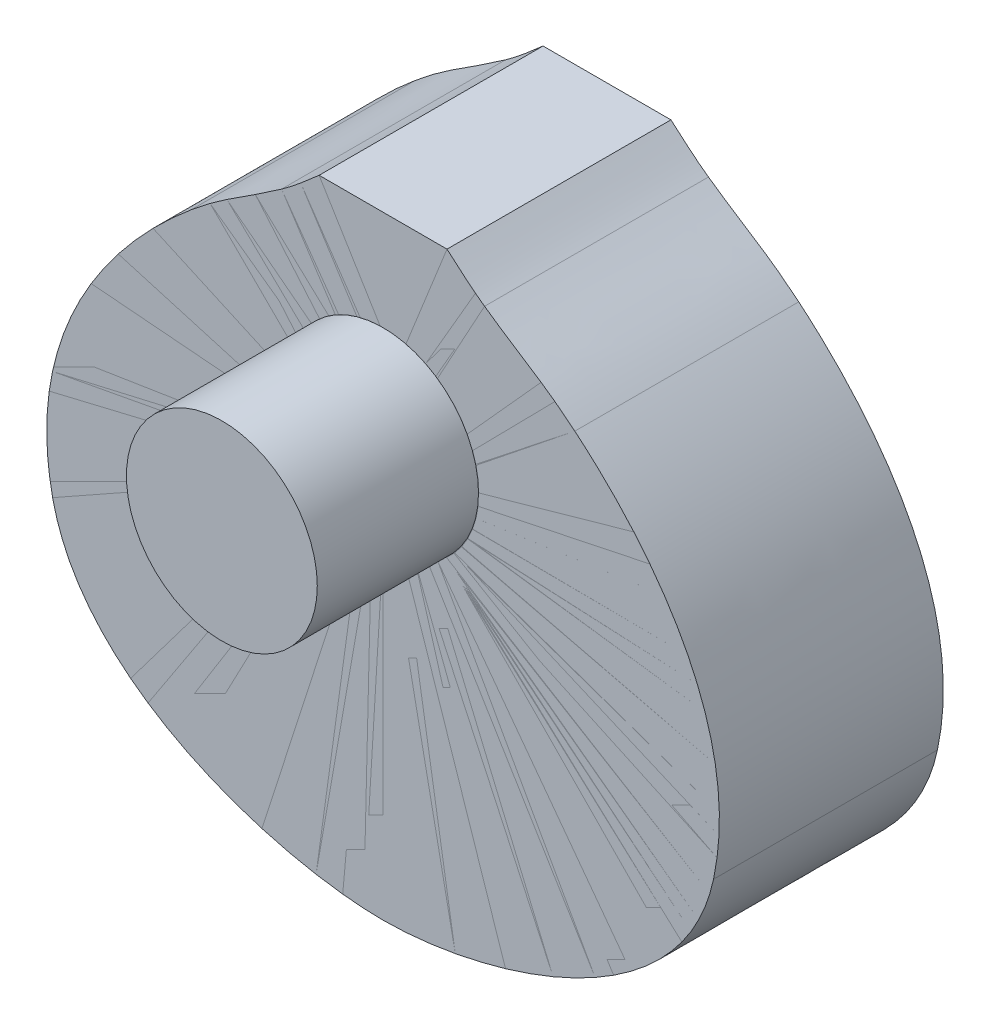
ISO-10303-21;
HEADER;
FILE_DESCRIPTION(('STEP AP214'),'2;1');
FILE_NAME('part.step','',(''),(''),'','','');
FILE_SCHEMA(('AUTOMOTIVE_DESIGN { 1 0 10303 214 1 1 1 1 }'));
ENDSEC;
DATA;
#1=APPLICATION_CONTEXT('core data for automotive mechanical design processes');
#2=APPLICATION_PROTOCOL_DEFINITION('international standard','automotive_design',2000,#1);
#3=PRODUCT_CONTEXT('',#1,'mechanical');
#4=PRODUCT('Part','Part','',(#3));
#5=PRODUCT_RELATED_PRODUCT_CATEGORY('part','',(#4));
#6=PRODUCT_DEFINITION_FORMATION('','',#4);
#7=PRODUCT_DEFINITION_CONTEXT('part definition',#1,'design');
#8=PRODUCT_DEFINITION('design','',#6,#7);
#9=PRODUCT_DEFINITION_SHAPE('','',#8);
#10=(LENGTH_UNIT() NAMED_UNIT(*) SI_UNIT(.MILLI.,.METRE.));
#11=(NAMED_UNIT(*) PLANE_ANGLE_UNIT() SI_UNIT($,.RADIAN.));
#12=(NAMED_UNIT(*) SI_UNIT($,.STERADIAN.) SOLID_ANGLE_UNIT());
#13=UNCERTAINTY_MEASURE_WITH_UNIT(LENGTH_MEASURE(1.E-05),#10,'distance_accuracy_value','');
#14=(GEOMETRIC_REPRESENTATION_CONTEXT(3) GLOBAL_UNCERTAINTY_ASSIGNED_CONTEXT((#13)) GLOBAL_UNIT_ASSIGNED_CONTEXT((#10,
#11,#12)) REPRESENTATION_CONTEXT('',''));
#15=CARTESIAN_POINT('',(0.,0.,0.));
#16=DIRECTION('',(0.,0.,1.));
#17=DIRECTION('',(1.,0.,0.));
#18=AXIS2_PLACEMENT_3D('',#15,#16,#17);
#19=CARTESIAN_POINT('',(-86.0503422010161,-116.244162405099,100.));
#20=DIRECTION('',(0.,0.,1.));
#21=DIRECTION('',(1.,0.,0.));
#22=AXIS2_PLACEMENT_3D('',#19,#20,#21);
#23=PLANE('',#22);
#24=CARTESIAN_POINT('',(-147.578497365594,-47.2764964103053,100.));
#25=CARTESIAN_POINT('',(-133.833406390178,-111.670406770875,100.));
#26=CARTESIAN_POINT('',(-46.441340442,-136.916395601955,100.));
#27=CARTESIAN_POINT('',(2.54000098731666E-07,-136.916395712,100.));
#28=B_SPLINE_CURVE_WITH_KNOTS('',3,(#24,#25,#26,#27),.UNSPECIFIED.,.F.,.F.,(4,4),(0.,1.),.UNSPECIFIED.);
#29=CARTESIAN_POINT('',(-147.578497365594,-47.2764964103053,100.));
#30=VERTEX_POINT('',#29);
#31=CARTESIAN_POINT('',(2.53999987709363E-07,-136.916395712,100.));
#32=VERTEX_POINT('',#31);
#33=EDGE_CURVE('E55',#30,#32,#28,.T.);
#34=ORIENTED_EDGE('',*,*,#33,.T.);
#35=DIRECTION('',(0.,1.,0.));
#36=VECTOR('',#35,1.);
#37=CARTESIAN_POINT('',(2.54000043220515E-07,6.76991712428551,100.));
#38=LINE('',#37,#36);
#39=CARTESIAN_POINT('',(2.54000035364103E-07,6.76991712428551,100.));
#40=VERTEX_POINT('',#39);
#41=EDGE_CURVE('E78',#32,#40,#38,.T.);
#42=ORIENTED_EDGE('',*,*,#41,.T.);
#43=CARTESIAN_POINT('',(2.54000043220515E-07,49.5382312132487,100.));
#44=DIRECTION('',(0.,0.,-1.));
#45=DIRECTION('',(1.,0.,0.));
#46=AXIS2_PLACEMENT_3D('',#43,#44,#45);
#47=CIRCLE('',#46,42.7683140889631);
#48=CARTESIAN_POINT('',(2.5400007097609E-07,92.3065453022118,100.));
#49=VERTEX_POINT('',#48);
#50=EDGE_CURVE('E83',#40,#49,#47,.T.);
#51=ORIENTED_EDGE('',*,*,#50,.T.);
#52=DIRECTION('',(0.,1.,0.));
#53=VECTOR('',#52,1.);
#54=CARTESIAN_POINT('',(2.54000043220515E-07,136.916395712,100.));
#55=LINE('',#54,#53);
#56=CARTESIAN_POINT('',(2.54000043220515E-07,136.916395712,100.));
#57=VERTEX_POINT('',#56);
#58=EDGE_CURVE('E88',#49,#57,#55,.T.);
#59=ORIENTED_EDGE('',*,*,#58,.T.);
#60=DIRECTION('',(-1.,0.,0.));
#61=VECTOR('',#60,1.);
#62=CARTESIAN_POINT('',(-28.5608021619999,136.916395712,100.));
#63=LINE('',#62,#61);
#64=CARTESIAN_POINT('',(-28.5608021619999,136.916395712,100.));
#65=VERTEX_POINT('',#64);
#66=EDGE_CURVE('E95',#57,#65,#63,.T.);
#67=ORIENTED_EDGE('',*,*,#66,.T.);
#68=CARTESIAN_POINT('',(-28.5608021619999,136.916395712,100.));
#69=CARTESIAN_POINT('',(-33.9335229379999,132.194713512,100.));
#70=CARTESIAN_POINT('',(-39.5023428899999,127.304974752,100.));
#71=CARTESIAN_POINT('',(-45.3232060259999,123.188624336,100.));
#72=B_SPLINE_CURVE_WITH_KNOTS('',3,(#68,#69,#70,#71),.UNSPECIFIED.,.F.,.F.,(4,4),(0.,1.),.UNSPECIFIED.);
#73=CARTESIAN_POINT('',(-45.3232060259999,123.188624336,100.));
#74=VERTEX_POINT('',#73);
#75=EDGE_CURVE('E98',#65,#74,#72,.T.);
#76=ORIENTED_EDGE('',*,*,#75,.T.);
#77=CARTESIAN_POINT('',(-45.3232060259999,123.188624336,100.));
#78=CARTESIAN_POINT('',(-62.7857659699999,110.83954464,100.));
#79=CARTESIAN_POINT('',(-70.7786958819999,107.475422336,100.));
#80=CARTESIAN_POINT('',(-85.6393976819999,95.0587593360001,100.));
#81=B_SPLINE_CURVE_WITH_KNOTS('',3,(#77,#78,#79,#80),.UNSPECIFIED.,.F.,.F.,(4,4),(0.,1.),.UNSPECIFIED.);
#82=CARTESIAN_POINT('',(-85.6393976819999,95.0587593360001,100.));
#83=VERTEX_POINT('',#82);
#84=EDGE_CURVE('E51',#74,#83,#81,.T.);
#85=ORIENTED_EDGE('',*,*,#84,.T.);
#86=CARTESIAN_POINT('',(-85.6393976819999,95.0587593360001,100.));
#87=CARTESIAN_POINT('',(-105.36071774303,78.5808853673423,100.));
#88=CARTESIAN_POINT('',(-163.110192586785,25.4872575653832,100.));
#89=CARTESIAN_POINT('',(-147.578497365594,-47.2764964103053,100.));
#90=B_SPLINE_CURVE_WITH_KNOTS('',3,(#86,#87,#88,#89),.UNSPECIFIED.,.F.,.F.,(4,4),(0.,1.),.UNSPECIFIED.);
#91=EDGE_CURVE('E12',#83,#30,#90,.T.);
#92=ORIENTED_EDGE('',*,*,#91,.T.);
#93=EDGE_LOOP('',(#34,#42,#51,#59,#67,#76,#85,#92));
#94=FACE_BOUND('',#93,.T.);
#95=ADVANCED_FACE('F44',(#94),#23,.T.);
#96=OPEN_SHELL('',(#95));
#97=SHELL_BASED_SURFACE_MODEL('B2',(#96));
#98=CARTESIAN_POINT('',(2.54000051894132E-07,49.5382312132486,100.));
#99=DIRECTION('',(0.,0.,-1.));
#100=DIRECTION('',(-1.,0.,0.));
#101=AXIS2_PLACEMENT_3D('',#98,#99,#100);
#102=PLANE('',#101);
#103=DIRECTION('',(-1.,0.,0.));
#104=VECTOR('',#103,1.);
#105=CARTESIAN_POINT('',(28.5608026699999,136.916395712,100.));
#106=LINE('',#105,#104);
#107=CARTESIAN_POINT('',(28.5608026699999,136.916395712,100.));
#108=VERTEX_POINT('',#107);
#109=CARTESIAN_POINT('',(2.54000051894132E-07,136.916395712,100.));
#110=VERTEX_POINT('',#109);
#111=EDGE_CURVE('E164',#108,#110,#106,.T.);
#112=ORIENTED_EDGE('',*,*,#111,.T.);
#113=DIRECTION('',(0.,-1.,0.));
#114=VECTOR('',#113,1.);
#115=CARTESIAN_POINT('',(2.54000051894132E-07,136.916395712,100.));
#116=LINE('',#115,#114);
#117=CARTESIAN_POINT('',(2.54000051894132E-07,92.3065453022117,100.));
#118=VERTEX_POINT('',#117);
#119=EDGE_CURVE('E187',#110,#118,#116,.T.);
#120=ORIENTED_EDGE('',*,*,#119,.T.);
#121=CARTESIAN_POINT('',(2.54000051894132E-07,49.5382312132486,100.));
#122=DIRECTION('',(0.,0.,-1.));
#123=DIRECTION('',(-1.,0.,0.));
#124=AXIS2_PLACEMENT_3D('',#121,#122,#123);
#125=CIRCLE('',#124,42.7683140889631);
#126=CARTESIAN_POINT('',(2.54000059750544E-07,6.76991712428546,100.));
#127=VERTEX_POINT('',#126);
#128=EDGE_CURVE('E192',#118,#127,#125,.T.);
#129=ORIENTED_EDGE('',*,*,#128,.T.);
#130=DIRECTION('',(0.,-1.,0.));
#131=VECTOR('',#130,1.);
#132=CARTESIAN_POINT('',(2.54000051894132E-07,6.76991712428546,100.));
#133=LINE('',#132,#131);
#134=CARTESIAN_POINT('',(2.5399994087183E-07,-136.916395712,100.));
#135=VERTEX_POINT('',#134);
#136=EDGE_CURVE('E197',#127,#135,#133,.T.);
#137=ORIENTED_EDGE('',*,*,#136,.T.);
#138=CARTESIAN_POINT('',(2.54000051894132E-07,-136.916395712,100.));
#139=CARTESIAN_POINT('',(46.4413409500002,-136.916395601955,100.));
#140=CARTESIAN_POINT('',(133.833406898179,-111.670406770875,100.));
#141=CARTESIAN_POINT('',(147.578497873594,-47.2764964103053,100.));
#142=B_SPLINE_CURVE_WITH_KNOTS('',3,(#138,#139,#140,#141),.UNSPECIFIED.,.F.,.F.,(4,4),(0.,1.),.UNSPECIFIED.);
#143=CARTESIAN_POINT('',(147.578497873594,-47.2764964103053,100.));
#144=VERTEX_POINT('',#143);
#145=EDGE_CURVE('E202',#135,#144,#142,.T.);
#146=ORIENTED_EDGE('',*,*,#145,.T.);
#147=CARTESIAN_POINT('',(147.578497873594,-47.2764964103053,100.));
#148=CARTESIAN_POINT('',(163.110193094786,25.4872575653832,100.));
#149=CARTESIAN_POINT('',(105.36071825103,78.5808853673423,100.));
#150=CARTESIAN_POINT('',(85.63939819,95.058759336,100.));
#151=B_SPLINE_CURVE_WITH_KNOTS('',3,(#147,#148,#149,#150),.UNSPECIFIED.,.F.,.F.,(4,4),(0.,1.),.UNSPECIFIED.);
#152=CARTESIAN_POINT('',(85.63939819,95.058759336,100.));
#153=VERTEX_POINT('',#152);
#154=EDGE_CURVE('E207',#144,#153,#151,.T.);
#155=ORIENTED_EDGE('',*,*,#154,.T.);
#156=CARTESIAN_POINT('',(85.63939819,95.058759336,100.));
#157=CARTESIAN_POINT('',(70.77869639,107.475422336,100.));
#158=CARTESIAN_POINT('',(62.7857664779999,110.83954464,100.));
#159=CARTESIAN_POINT('',(45.323206534,123.188624336,100.));
#160=B_SPLINE_CURVE_WITH_KNOTS('',3,(#156,#157,#158,#159),.UNSPECIFIED.,.F.,.F.,(4,4),(0.,1.),.UNSPECIFIED.);
#161=CARTESIAN_POINT('',(45.323206534,123.188624336,100.));
#162=VERTEX_POINT('',#161);
#163=EDGE_CURVE('E160',#153,#162,#160,.T.);
#164=ORIENTED_EDGE('',*,*,#163,.T.);
#165=CARTESIAN_POINT('',(45.323206534,123.188624336,100.));
#166=CARTESIAN_POINT('',(39.502343398,127.304974752,100.));
#167=CARTESIAN_POINT('',(33.933523446,132.194713512,100.));
#168=CARTESIAN_POINT('',(28.5608026699999,136.916395712,100.));
#169=B_SPLINE_CURVE_WITH_KNOTS('',3,(#165,#166,#167,#168),.UNSPECIFIED.,.F.,.F.,(4,4),(0.,1.),.UNSPECIFIED.);
#170=EDGE_CURVE('E42',#162,#108,#169,.T.);
#171=ORIENTED_EDGE('',*,*,#170,.T.);
#172=EDGE_LOOP('',(#112,#120,#129,#137,#146,#155,#164,#171));
#173=FACE_BOUND('',#172,.T.);
#174=ADVANCED_FACE('F153',(#173),#102,.F.);
#175=OPEN_SHELL('',(#174));
#176=SHELL_BASED_SURFACE_MODEL('B6',(#175));
#177=CARTESIAN_POINT('',(-86.0503422010161,-116.244162405099,100.));
#178=DIRECTION('',(0.,0.,1.));
#179=DIRECTION('',(1.,0.,0.));
#180=AXIS2_PLACEMENT_3D('',#177,#178,#179);
#181=PLANE('',#180);
#182=CARTESIAN_POINT('',(-147.578497365594,-47.2764964103054,100.));
#183=CARTESIAN_POINT('',(-133.833406390178,-111.670406770875,100.));
#184=CARTESIAN_POINT('',(-46.441340442,-136.916395601955,100.));
#185=CARTESIAN_POINT('',(2.54000087163701E-07,-136.916395712,100.));
#186=B_SPLINE_CURVE_WITH_KNOTS('',3,(#182,#183,#184,#185),.UNSPECIFIED.,.F.,.F.,(4,4),(0.,1.),.UNSPECIFIED.);
#187=CARTESIAN_POINT('',(-147.578497365594,-47.2764964103054,100.));
#188=VERTEX_POINT('',#187);
#189=CARTESIAN_POINT('',(2.53999985488917E-07,-136.916395712,100.));
#190=VERTEX_POINT('',#189);
#191=EDGE_CURVE('E304',#188,#190,#186,.T.);
#192=ORIENTED_EDGE('',*,*,#191,.T.);
#193=CARTESIAN_POINT('',(0.,-136.916395712,100.));
#194=CARTESIAN_POINT('',(46.4413406959999,-136.916395629466,100.));
#195=CARTESIAN_POINT('',(133.833406659134,-111.670406850156,100.));
#196=CARTESIAN_POINT('',(147.578497672695,-47.2764964977289,100.));
#197=B_SPLINE_CURVE_WITH_KNOTS('',3,(#193,#194,#195,#196),.UNSPECIFIED.,.F.,.F.,(4,4),(0.,1.),.UNSPECIFIED.);
#198=CARTESIAN_POINT('',(147.578497672695,-47.2764964977289,100.));
#199=VERTEX_POINT('',#198);
#200=EDGE_CURVE('E439',#190,#199,#197,.T.);
#201=ORIENTED_EDGE('',*,*,#200,.T.);
#202=CARTESIAN_POINT('',(147.578497672695,-47.2764964977289,100.));
#203=CARTESIAN_POINT('',(163.110192996589,25.4872574560373,100.));
#204=CARTESIAN_POINT('',(105.360718227773,78.5808853395067,100.));
#205=CARTESIAN_POINT('',(85.63939819,95.058759336,100.));
#206=B_SPLINE_CURVE_WITH_KNOTS('',3,(#202,#203,#204,#205),.UNSPECIFIED.,.F.,.F.,(4,4),(0.,1.),.UNSPECIFIED.);
#207=CARTESIAN_POINT('',(85.63939819,95.058759336,100.));
#208=VERTEX_POINT('',#207);
#209=EDGE_CURVE('E450',#199,#208,#206,.T.);
#210=ORIENTED_EDGE('',*,*,#209,.T.);
#211=CARTESIAN_POINT('',(85.63939819,95.058759336,100.));
#212=CARTESIAN_POINT('',(70.77869639,107.475422336,100.));
#213=CARTESIAN_POINT('',(62.785766478,110.83954464,100.));
#214=CARTESIAN_POINT('',(45.323206534,123.188624336,100.));
#215=B_SPLINE_CURVE_WITH_KNOTS('',3,(#211,#212,#213,#214),.UNSPECIFIED.,.F.,.F.,(4,4),(0.,1.),.UNSPECIFIED.);
#216=CARTESIAN_POINT('',(45.323206534,123.188624336,100.));
#217=VERTEX_POINT('',#216);
#218=EDGE_CURVE('E499',#208,#217,#215,.T.);
#219=ORIENTED_EDGE('',*,*,#218,.T.);
#220=CARTESIAN_POINT('',(45.323206534,123.188624336,100.));
#221=CARTESIAN_POINT('',(39.502343398,127.304974752,100.));
#222=CARTESIAN_POINT('',(33.933523446,132.194713512,100.));
#223=CARTESIAN_POINT('',(28.56080267,136.916395712,100.));
#224=B_SPLINE_CURVE_WITH_KNOTS('',3,(#220,#221,#222,#223),.UNSPECIFIED.,.F.,.F.,(4,4),(0.,1.),.UNSPECIFIED.);
#225=CARTESIAN_POINT('',(28.56080267,136.916395712,100.));
#226=VERTEX_POINT('',#225);
#227=EDGE_CURVE('E480',#217,#226,#224,.T.);
#228=ORIENTED_EDGE('',*,*,#227,.T.);
#229=DIRECTION('',(-1.,0.,0.));
#230=VECTOR('',#229,1.);
#231=CARTESIAN_POINT('',(-28.5608021619999,136.916395712,100.));
#232=LINE('',#231,#230);
#233=CARTESIAN_POINT('',(-28.5608021619999,136.916395712,100.));
#234=VERTEX_POINT('',#233);
#235=EDGE_CURVE('E320',#226,#234,#232,.T.);
#236=ORIENTED_EDGE('',*,*,#235,.T.);
#237=CARTESIAN_POINT('',(-28.5608021619999,136.916395712,100.));
#238=CARTESIAN_POINT('',(-33.9335229379999,132.194713512,100.));
#239=CARTESIAN_POINT('',(-39.5023428899999,127.304974752,100.));
#240=CARTESIAN_POINT('',(-45.3232060259999,123.188624336,100.));
#241=B_SPLINE_CURVE_WITH_KNOTS('',3,(#237,#238,#239,#240),.UNSPECIFIED.,.F.,.F.,(4,4),(0.,1.),.UNSPECIFIED.);
#242=CARTESIAN_POINT('',(-45.3232060259999,123.188624336,100.));
#243=VERTEX_POINT('',#242);
#244=EDGE_CURVE('E313',#234,#243,#241,.T.);
#245=ORIENTED_EDGE('',*,*,#244,.T.);
#246=CARTESIAN_POINT('',(-45.3232060259999,123.188624336,100.));
#247=CARTESIAN_POINT('',(-62.7857659699999,110.83954464,100.));
#248=CARTESIAN_POINT('',(-70.7786958819999,107.475422336,100.));
#249=CARTESIAN_POINT('',(-85.6393976819999,95.058759336,100.));
#250=B_SPLINE_CURVE_WITH_KNOTS('',3,(#246,#247,#248,#249),.UNSPECIFIED.,.F.,.F.,(4,4),(0.,1.),.UNSPECIFIED.);
#251=CARTESIAN_POINT('',(-85.6393976819999,95.058759336,100.));
#252=VERTEX_POINT('',#251);
#253=EDGE_CURVE('E317',#243,#252,#250,.T.);
#254=ORIENTED_EDGE('',*,*,#253,.T.);
#255=CARTESIAN_POINT('',(-85.6393976819999,95.058759336,100.));
#256=CARTESIAN_POINT('',(-105.36071774303,78.5808853673423,100.));
#257=CARTESIAN_POINT('',(-163.110192586785,25.4872575653832,100.));
#258=CARTESIAN_POINT('',(-147.578497365594,-47.2764964103054,100.));
#259=B_SPLINE_CURVE_WITH_KNOTS('',3,(#255,#256,#257,#258),.UNSPECIFIED.,.F.,.F.,(4,4),(0.,1.),.UNSPECIFIED.);
#260=EDGE_CURVE('E271',#252,#188,#259,.T.);
#261=ORIENTED_EDGE('',*,*,#260,.T.);
#262=EDGE_LOOP('',(#192,#201,#210,#219,#228,#236,#245,#254,#261));
#263=FACE_BOUND('',#262,.T.);
#264=CARTESIAN_POINT('',(2.54000031916041E-07,49.6594816289135,100.));
#265=DIRECTION('',(0.,0.,1.));
#266=DIRECTION('',(1.,0.,0.));
#267=AXIS2_PLACEMENT_3D('',#264,#265,#266);
#268=CIRCLE('',#267,42.6235073127831);
#269=CARTESIAN_POINT('',(42.6235075667832,49.6594816289135,100.));
#270=VERTEX_POINT('',#269);
#271=EDGE_CURVE('E512',#270,#270,#268,.T.);
#272=ORIENTED_EDGE('',*,*,#271,.F.);
#273=EDGE_LOOP('',(#272));
#274=FACE_BOUND('',#273,.T.);
#275=ADVANCED_FACE('F253',(#263,#274),#181,.T.);
#276=DIRECTION('',(0.,0.,-1.));
#277=VECTOR('',#276,1.);
#278=SURFACE_OF_LINEAR_EXTRUSION('',#186,#277);
#279=CARTESIAN_POINT('',(-147.578497365594,-47.2764964103054,0.));
#280=CARTESIAN_POINT('',(-133.833406390178,-111.670406770875,0.));
#281=CARTESIAN_POINT('',(-46.441340442,-136.916395601955,0.));
#282=CARTESIAN_POINT('',(2.54000087163701E-07,-136.916395712,0.));
#283=B_SPLINE_CURVE_WITH_KNOTS('',3,(#279,#280,#281,#282),.UNSPECIFIED.,.F.,.F.,(4,4),(0.,1.),.UNSPECIFIED.);
#284=CARTESIAN_POINT('',(-147.578497365594,-47.2764964103054,0.));
#285=VERTEX_POINT('',#284);
#286=CARTESIAN_POINT('',(2.53999985488917E-07,-136.916395712,0.));
#287=VERTEX_POINT('',#286);
#288=EDGE_CURVE('E382',#285,#287,#283,.T.);
#289=ORIENTED_EDGE('',*,*,#288,.T.);
#290=DIRECTION('',(0.,0.,-1.));
#291=VECTOR('',#290,1.);
#292=CARTESIAN_POINT('',(2.53999985488917E-07,-136.916395712,100.));
#293=LINE('',#292,#291);
#294=EDGE_CURVE('E151',#190,#287,#293,.T.);
#295=ORIENTED_EDGE('',*,*,#294,.F.);
#296=ORIENTED_EDGE('',*,*,#191,.F.);
#297=DIRECTION('',(0.,0.,-1.));
#298=VECTOR('',#297,1.);
#299=CARTESIAN_POINT('',(-147.578497365594,-47.2764964103054,100.));
#300=LINE('',#299,#298);
#301=EDGE_CURVE('E333',#188,#285,#300,.T.);
#302=ORIENTED_EDGE('',*,*,#301,.T.);
#303=EDGE_LOOP('',(#289,#295,#296,#302));
#304=FACE_BOUND('',#303,.T.);
#305=ADVANCED_FACE('F255',(#304),#278,.F.);
#306=CARTESIAN_POINT('',(-28.5608021619999,136.916395712,100.));
#307=DIRECTION('',(0.,-1.,0.));
#308=DIRECTION('',(0.,0.,-1.));
#309=AXIS2_PLACEMENT_3D('',#306,#307,#308);
#310=PLANE('',#309);
#311=DIRECTION('',(-1.,0.,0.));
#312=VECTOR('',#311,1.);
#313=CARTESIAN_POINT('',(-28.5608021619999,136.916395712,0.));
#314=LINE('',#313,#312);
#315=CARTESIAN_POINT('',(28.56080267,136.916395712,0.));
#316=VERTEX_POINT('',#315);
#317=CARTESIAN_POINT('',(-28.5608021619999,136.916395712,0.));
#318=VERTEX_POINT('',#317);
#319=EDGE_CURVE('E386',#316,#318,#314,.T.);
#320=ORIENTED_EDGE('',*,*,#319,.T.);
#321=DIRECTION('',(0.,0.,-1.));
#322=VECTOR('',#321,1.);
#323=CARTESIAN_POINT('',(-28.5608021619999,136.916395712,100.));
#324=LINE('',#323,#322);
#325=EDGE_CURVE('E263',#234,#318,#324,.T.);
#326=ORIENTED_EDGE('',*,*,#325,.F.);
#327=ORIENTED_EDGE('',*,*,#235,.F.);
#328=DIRECTION('',(0.,0.,-1.));
#329=VECTOR('',#328,1.);
#330=CARTESIAN_POINT('',(28.56080267,136.916395712,100.));
#331=LINE('',#330,#329);
#332=EDGE_CURVE('E431',#226,#316,#331,.T.);
#333=ORIENTED_EDGE('',*,*,#332,.T.);
#334=EDGE_LOOP('',(#320,#326,#327,#333));
#335=FACE_BOUND('',#334,.T.);
#336=ADVANCED_FACE('F356',(#335),#310,.F.);
#337=DIRECTION('',(0.,0.,-1.));
#338=VECTOR('',#337,1.);
#339=SURFACE_OF_LINEAR_EXTRUSION('',#241,#338);
#340=CARTESIAN_POINT('',(-28.5608021619999,136.916395712,0.));
#341=CARTESIAN_POINT('',(-33.9335229379999,132.194713512,0.));
#342=CARTESIAN_POINT('',(-39.5023428899999,127.304974752,0.));
#343=CARTESIAN_POINT('',(-45.3232060259999,123.188624336,0.));
#344=B_SPLINE_CURVE_WITH_KNOTS('',3,(#340,#341,#342,#343),.UNSPECIFIED.,.F.,.F.,(4,4),(0.,1.),.UNSPECIFIED.);
#345=CARTESIAN_POINT('',(-45.3232060259999,123.188624336,0.));
#346=VERTEX_POINT('',#345);
#347=EDGE_CURVE('E328',#318,#346,#344,.T.);
#348=ORIENTED_EDGE('',*,*,#347,.T.);
#349=DIRECTION('',(0.,0.,-1.));
#350=VECTOR('',#349,1.);
#351=CARTESIAN_POINT('',(-45.3232060259999,123.188624336,100.));
#352=LINE('',#351,#350);
#353=EDGE_CURVE('E325',#243,#346,#352,.T.);
#354=ORIENTED_EDGE('',*,*,#353,.F.);
#355=ORIENTED_EDGE('',*,*,#244,.F.);
#356=ORIENTED_EDGE('',*,*,#325,.T.);
#357=EDGE_LOOP('',(#348,#354,#355,#356));
#358=FACE_BOUND('',#357,.T.);
#359=ADVANCED_FACE('F326',(#358),#339,.F.);
#360=DIRECTION('',(0.,0.,-1.));
#361=VECTOR('',#360,1.);
#362=SURFACE_OF_LINEAR_EXTRUSION('',#250,#361);
#363=CARTESIAN_POINT('',(-45.3232060259999,123.188624336,0.));
#364=CARTESIAN_POINT('',(-62.7857659699999,110.83954464,0.));
#365=CARTESIAN_POINT('',(-70.7786958819999,107.475422336,0.));
#366=CARTESIAN_POINT('',(-85.6393976819999,95.058759336,0.));
#367=B_SPLINE_CURVE_WITH_KNOTS('',3,(#363,#364,#365,#366),.UNSPECIFIED.,.F.,.F.,(4,4),(0.,1.),.UNSPECIFIED.);
#368=CARTESIAN_POINT('',(-85.6393976819999,95.058759336,0.));
#369=VERTEX_POINT('',#368);
#370=EDGE_CURVE('E292',#346,#369,#367,.T.);
#371=ORIENTED_EDGE('',*,*,#370,.T.);
#372=DIRECTION('',(0.,0.,-1.));
#373=VECTOR('',#372,1.);
#374=CARTESIAN_POINT('',(-85.6393976819999,95.058759336,100.));
#375=LINE('',#374,#373);
#376=EDGE_CURVE('E329',#252,#369,#375,.T.);
#377=ORIENTED_EDGE('',*,*,#376,.F.);
#378=ORIENTED_EDGE('',*,*,#253,.F.);
#379=ORIENTED_EDGE('',*,*,#353,.T.);
#380=EDGE_LOOP('',(#371,#377,#378,#379));
#381=FACE_BOUND('',#380,.T.);
#382=ADVANCED_FACE('F331',(#381),#362,.F.);
#383=DIRECTION('',(0.,0.,-1.));
#384=VECTOR('',#383,1.);
#385=SURFACE_OF_LINEAR_EXTRUSION('',#259,#384);
#386=CARTESIAN_POINT('',(-85.6393976819999,95.058759336,0.));
#387=CARTESIAN_POINT('',(-105.36071774303,78.5808853673423,0.));
#388=CARTESIAN_POINT('',(-163.110192586785,25.4872575653832,0.));
#389=CARTESIAN_POINT('',(-147.578497365594,-47.2764964103054,0.));
#390=B_SPLINE_CURVE_WITH_KNOTS('',3,(#386,#387,#388,#389),.UNSPECIFIED.,.F.,.F.,(4,4),(0.,1.),.UNSPECIFIED.);
#391=EDGE_CURVE('E298',#369,#285,#390,.T.);
#392=ORIENTED_EDGE('',*,*,#391,.T.);
#393=ORIENTED_EDGE('',*,*,#301,.F.);
#394=ORIENTED_EDGE('',*,*,#260,.F.);
#395=ORIENTED_EDGE('',*,*,#376,.T.);
#396=EDGE_LOOP('',(#392,#393,#394,#395));
#397=FACE_BOUND('',#396,.T.);
#398=ADVANCED_FACE('F353',(#397),#385,.F.);
#399=CARTESIAN_POINT('',(-86.0503422010161,-116.244162405099,0.));
#400=DIRECTION('',(0.,0.,1.));
#401=DIRECTION('',(1.,0.,0.));
#402=AXIS2_PLACEMENT_3D('',#399,#400,#401);
#403=PLANE('',#402);
#404=ORIENTED_EDGE('',*,*,#288,.F.);
#405=ORIENTED_EDGE('',*,*,#391,.F.);
#406=ORIENTED_EDGE('',*,*,#370,.F.);
#407=ORIENTED_EDGE('',*,*,#347,.F.);
#408=ORIENTED_EDGE('',*,*,#319,.F.);
#409=CARTESIAN_POINT('',(45.323206534,123.188624336,0.));
#410=CARTESIAN_POINT('',(39.502343398,127.304974752,0.));
#411=CARTESIAN_POINT('',(33.933523446,132.194713512,0.));
#412=CARTESIAN_POINT('',(28.56080267,136.916395712,0.));
#413=B_SPLINE_CURVE_WITH_KNOTS('',3,(#409,#410,#411,#412),.UNSPECIFIED.,.F.,.F.,(4,4),(0.,1.),.UNSPECIFIED.);
#414=CARTESIAN_POINT('',(45.323206534,123.188624336,0.));
#415=VERTEX_POINT('',#414);
#416=EDGE_CURVE('E423',#415,#316,#413,.T.);
#417=ORIENTED_EDGE('',*,*,#416,.F.);
#418=CARTESIAN_POINT('',(85.63939819,95.058759336,0.));
#419=CARTESIAN_POINT('',(70.77869639,107.475422336,0.));
#420=CARTESIAN_POINT('',(62.785766478,110.83954464,0.));
#421=CARTESIAN_POINT('',(45.323206534,123.188624336,0.));
#422=B_SPLINE_CURVE_WITH_KNOTS('',3,(#418,#419,#420,#421),.UNSPECIFIED.,.F.,.F.,(4,4),(0.,1.),.UNSPECIFIED.);
#423=CARTESIAN_POINT('',(85.63939819,95.058759336,0.));
#424=VERTEX_POINT('',#423);
#425=EDGE_CURVE('E433',#424,#415,#422,.T.);
#426=ORIENTED_EDGE('',*,*,#425,.F.);
#427=CARTESIAN_POINT('',(147.578497672695,-47.2764964977289,0.));
#428=CARTESIAN_POINT('',(163.110192996589,25.4872574560373,0.));
#429=CARTESIAN_POINT('',(105.360718227773,78.5808853395067,0.));
#430=CARTESIAN_POINT('',(85.63939819,95.058759336,0.));
#431=B_SPLINE_CURVE_WITH_KNOTS('',3,(#427,#428,#429,#430),.UNSPECIFIED.,.F.,.F.,(4,4),(0.,1.),.UNSPECIFIED.);
#432=CARTESIAN_POINT('',(147.578497672695,-47.2764964977289,0.));
#433=VERTEX_POINT('',#432);
#434=EDGE_CURVE('E464',#433,#424,#431,.T.);
#435=ORIENTED_EDGE('',*,*,#434,.F.);
#436=CARTESIAN_POINT('',(0.,-136.916395712,0.));
#437=CARTESIAN_POINT('',(46.4413406959999,-136.916395629466,0.));
#438=CARTESIAN_POINT('',(133.833406659134,-111.670406850156,0.));
#439=CARTESIAN_POINT('',(147.578497672695,-47.2764964977289,0.));
#440=B_SPLINE_CURVE_WITH_KNOTS('',3,(#436,#437,#438,#439),.UNSPECIFIED.,.F.,.F.,(4,4),(0.,1.),.UNSPECIFIED.);
#441=EDGE_CURVE('E385',#287,#433,#440,.T.);
#442=ORIENTED_EDGE('',*,*,#441,.F.);
#443=EDGE_LOOP('',(#404,#405,#406,#407,#408,#417,#426,#435,#442));
#444=FACE_BOUND('',#443,.T.);
#445=ADVANCED_FACE('F371',(#444),#403,.F.);
#446=DIRECTION('',(0.,0.,-1.));
#447=VECTOR('',#446,1.);
#448=SURFACE_OF_LINEAR_EXTRUSION('',#206,#447);
#449=ORIENTED_EDGE('',*,*,#434,.T.);
#450=DIRECTION('',(0.,0.,-1.));
#451=VECTOR('',#450,1.);
#452=CARTESIAN_POINT('',(85.63939819,95.058759336,100.));
#453=LINE('',#452,#451);
#454=EDGE_CURVE('E387',#208,#424,#453,.T.);
#455=ORIENTED_EDGE('',*,*,#454,.F.);
#456=ORIENTED_EDGE('',*,*,#209,.F.);
#457=DIRECTION('',(0.,0.,-1.));
#458=VECTOR('',#457,1.);
#459=CARTESIAN_POINT('',(147.578497672695,-47.2764964977289,100.));
#460=LINE('',#459,#458);
#461=EDGE_CURVE('E435',#199,#433,#460,.T.);
#462=ORIENTED_EDGE('',*,*,#461,.T.);
#463=EDGE_LOOP('',(#449,#455,#456,#462));
#464=FACE_BOUND('',#463,.T.);
#465=ADVANCED_FACE('F368',(#464),#448,.F.);
#466=DIRECTION('',(0.,0.,-1.));
#467=VECTOR('',#466,1.);
#468=SURFACE_OF_LINEAR_EXTRUSION('',#215,#467);
#469=ORIENTED_EDGE('',*,*,#425,.T.);
#470=DIRECTION('',(0.,0.,-1.));
#471=VECTOR('',#470,1.);
#472=CARTESIAN_POINT('',(45.323206534,123.188624336,100.));
#473=LINE('',#472,#471);
#474=EDGE_CURVE('E390',#217,#415,#473,.T.);
#475=ORIENTED_EDGE('',*,*,#474,.F.);
#476=ORIENTED_EDGE('',*,*,#218,.F.);
#477=ORIENTED_EDGE('',*,*,#454,.T.);
#478=EDGE_LOOP('',(#469,#475,#476,#477));
#479=FACE_BOUND('',#478,.T.);
#480=ADVANCED_FACE('F378',(#479),#468,.F.);
#481=DIRECTION('',(0.,0.,-1.));
#482=VECTOR('',#481,1.);
#483=SURFACE_OF_LINEAR_EXTRUSION('',#224,#482);
#484=ORIENTED_EDGE('',*,*,#416,.T.);
#485=ORIENTED_EDGE('',*,*,#332,.F.);
#486=ORIENTED_EDGE('',*,*,#227,.F.);
#487=ORIENTED_EDGE('',*,*,#474,.T.);
#488=EDGE_LOOP('',(#484,#485,#486,#487));
#489=FACE_BOUND('',#488,.T.);
#490=ADVANCED_FACE('F428',(#489),#483,.F.);
#491=DIRECTION('',(0.,0.,-1.));
#492=VECTOR('',#491,1.);
#493=SURFACE_OF_LINEAR_EXTRUSION('',#197,#492);
#494=ORIENTED_EDGE('',*,*,#441,.T.);
#495=ORIENTED_EDGE('',*,*,#461,.F.);
#496=ORIENTED_EDGE('',*,*,#200,.F.);
#497=ORIENTED_EDGE('',*,*,#294,.T.);
#498=EDGE_LOOP('',(#494,#495,#496,#497));
#499=FACE_BOUND('',#498,.T.);
#500=ADVANCED_FACE('F489',(#499),#493,.F.);
#501=CARTESIAN_POINT('',(2.54000031916041E-07,49.6594816289135,172.));
#502=DIRECTION('',(0.,0.,-1.));
#503=DIRECTION('',(-1.,0.,0.));
#504=AXIS2_PLACEMENT_3D('',#501,#502,#503);
#505=CYLINDRICAL_SURFACE('',#504,42.6235073127831);
#506=CARTESIAN_POINT('',(2.54000031916041E-07,49.6594816289135,172.));
#507=DIRECTION('',(0.,0.,1.));
#508=DIRECTION('',(1.,0.,0.));
#509=AXIS2_PLACEMENT_3D('',#506,#507,#508);
#510=CIRCLE('',#509,42.6235073127831);
#511=CARTESIAN_POINT('',(42.6235075667832,49.6594816289135,172.));
#512=VERTEX_POINT('',#511);
#513=EDGE_CURVE('E472',#512,#512,#510,.T.);
#514=ORIENTED_EDGE('',*,*,#513,.F.);
#515=EDGE_LOOP('',(#514));
#516=FACE_BOUND('',#515,.T.);
#517=ORIENTED_EDGE('',*,*,#271,.T.);
#518=EDGE_LOOP('',(#517));
#519=FACE_BOUND('',#518,.T.);
#520=ADVANCED_FACE('F493',(#516,#519),#505,.T.);
#521=CARTESIAN_POINT('',(2.54000031916041E-07,49.6594816289135,172.));
#522=DIRECTION('',(0.,0.,1.));
#523=DIRECTION('',(1.,0.,0.));
#524=AXIS2_PLACEMENT_3D('',#521,#522,#523);
#525=PLANE('',#524);
#526=ORIENTED_EDGE('',*,*,#513,.T.);
#527=EDGE_LOOP('',(#526));
#528=FACE_BOUND('',#527,.T.);
#529=ADVANCED_FACE('F521',(#528),#525,.T.);
#530=CLOSED_SHELL('',(#275,#305,#336,#359,#382,#398,#445,#465,#480,#490,#500,#520,#529));
#531=MANIFOLD_SOLID_BREP('B36',#530);
#532=ADVANCED_BREP_SHAPE_REPRESENTATION('',(#18,#531),#14);
#533=MANIFOLD_SURFACE_SHAPE_REPRESENTATION('',(#18,#97,#176),#14);
#534=SHAPE_REPRESENTATION('',(#18),#14);
#535=SHAPE_DEFINITION_REPRESENTATION(#9,#534);
#536=SHAPE_REPRESENTATION_RELATIONSHIP('','',#534,#532);
#537=SHAPE_REPRESENTATION_RELATIONSHIP('','',#534,#533);
ENDSEC;
END-ISO-10303-21;
